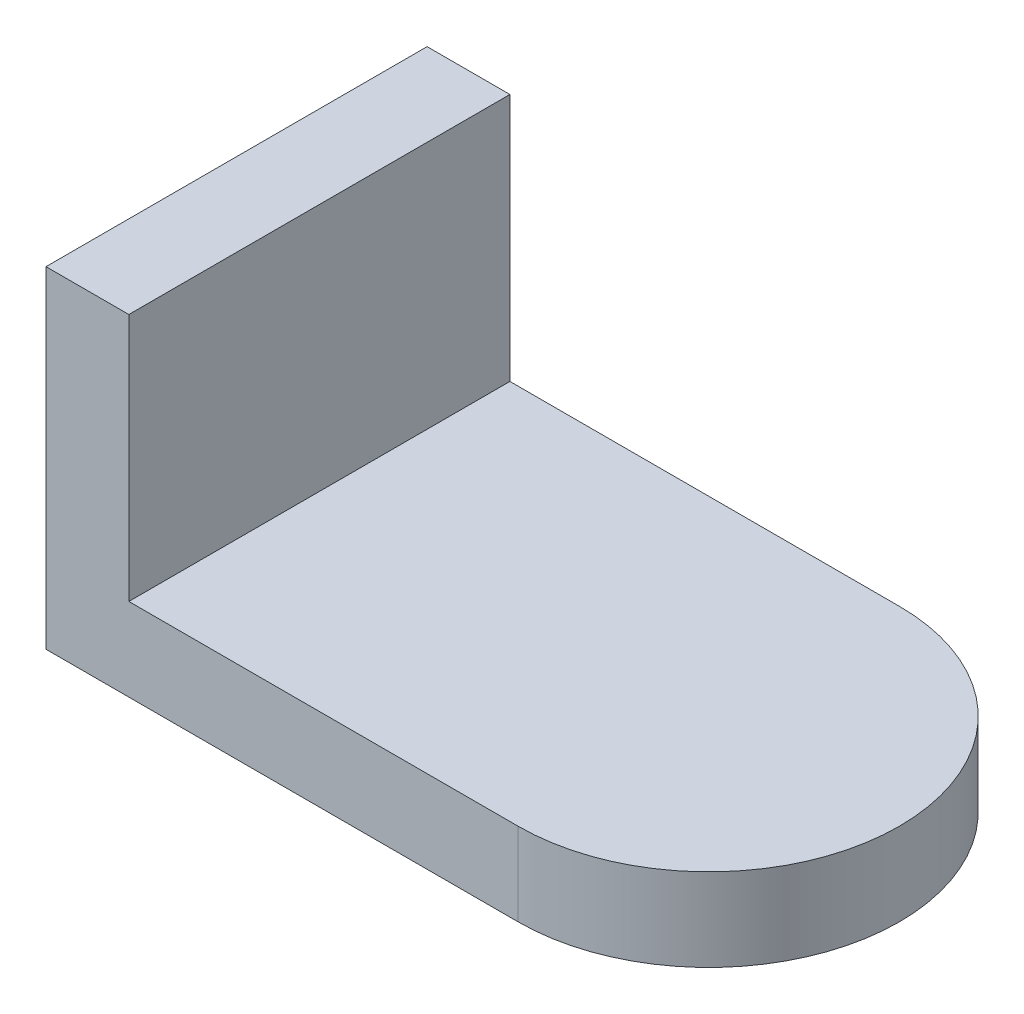
ISO-10303-21;
HEADER;
FILE_DESCRIPTION(('STEP AP214'),'2;1');
FILE_NAME('part.step','',(''),(''),'','','');
FILE_SCHEMA(('AUTOMOTIVE_DESIGN { 1 0 10303 214 1 1 1 1 }'));
ENDSEC;
DATA;
#1=APPLICATION_CONTEXT('core data for automotive mechanical design processes');
#2=APPLICATION_PROTOCOL_DEFINITION('international standard','automotive_design',2000,#1);
#3=PRODUCT_CONTEXT('',#1,'mechanical');
#4=PRODUCT('Part','Part','',(#3));
#5=PRODUCT_RELATED_PRODUCT_CATEGORY('part','',(#4));
#6=PRODUCT_DEFINITION_FORMATION('','',#4);
#7=PRODUCT_DEFINITION_CONTEXT('part definition',#1,'design');
#8=PRODUCT_DEFINITION('design','',#6,#7);
#9=PRODUCT_DEFINITION_SHAPE('','',#8);
#10=(LENGTH_UNIT() NAMED_UNIT(*) SI_UNIT(.MILLI.,.METRE.));
#11=(NAMED_UNIT(*) PLANE_ANGLE_UNIT() SI_UNIT($,.RADIAN.));
#12=(NAMED_UNIT(*) SI_UNIT($,.STERADIAN.) SOLID_ANGLE_UNIT());
#13=UNCERTAINTY_MEASURE_WITH_UNIT(LENGTH_MEASURE(1.E-05),#10,'distance_accuracy_value','');
#14=(GEOMETRIC_REPRESENTATION_CONTEXT(3) GLOBAL_UNCERTAINTY_ASSIGNED_CONTEXT((#13)) GLOBAL_UNIT_ASSIGNED_CONTEXT((#10,
#11,#12)) REPRESENTATION_CONTEXT('',''));
#15=CARTESIAN_POINT('',(0.,0.,0.));
#16=DIRECTION('',(0.,0.,1.));
#17=DIRECTION('',(1.,0.,0.));
#18=AXIS2_PLACEMENT_3D('',#15,#16,#17);
#19=CARTESIAN_POINT('',(-1.45,-0.2,0.135));
#20=DIRECTION('',(0.,0.,-1.));
#21=DIRECTION('',(-1.,0.,0.));
#22=AXIS2_PLACEMENT_3D('',#19,#20,#21);
#23=PLANE('',#22);
#24=DIRECTION('',(0.,-1.,0.));
#25=VECTOR('',#24,1.);
#26=CARTESIAN_POINT('',(-1.5,-0.2,0.135));
#27=LINE('',#26,#25);
#28=CARTESIAN_POINT('',(-1.5,-0.2,0.135));
#29=VERTEX_POINT('',#28);
#30=CARTESIAN_POINT('',(-1.5,-0.4,0.135));
#31=VERTEX_POINT('',#30);
#32=EDGE_CURVE('E11',#29,#31,#27,.T.);
#33=ORIENTED_EDGE('',*,*,#32,.F.);
#34=DIRECTION('',(-1.,0.,0.));
#35=VECTOR('',#34,1.);
#36=CARTESIAN_POINT('',(-1.45,-0.2,0.135));
#37=LINE('',#36,#35);
#38=CARTESIAN_POINT('',(-1.45,-0.2,0.135));
#39=VERTEX_POINT('',#38);
#40=EDGE_CURVE('E24',#39,#29,#37,.T.);
#41=ORIENTED_EDGE('',*,*,#40,.F.);
#42=DIRECTION('',(0.,-1.,0.));
#43=VECTOR('',#42,1.);
#44=CARTESIAN_POINT('',(-1.45,-0.2,0.135));
#45=LINE('',#44,#43);
#46=CARTESIAN_POINT('',(-1.45,-0.35,0.135));
#47=VERTEX_POINT('',#46);
#48=EDGE_CURVE('E116',#39,#47,#45,.T.);
#49=ORIENTED_EDGE('',*,*,#48,.T.);
#50=DIRECTION('',(1.,0.,0.));
#51=VECTOR('',#50,1.);
#52=CARTESIAN_POINT('',(-1.45,-0.35,0.135));
#53=LINE('',#52,#51);
#54=CARTESIAN_POINT('',(-1.215,-0.35,0.135));
#55=VERTEX_POINT('',#54);
#56=EDGE_CURVE('E90',#47,#55,#53,.T.);
#57=ORIENTED_EDGE('',*,*,#56,.T.);
#58=DIRECTION('',(0.,-1.,0.));
#59=VECTOR('',#58,1.);
#60=CARTESIAN_POINT('',(-1.215,-0.35,0.135));
#61=LINE('',#60,#59);
#62=CARTESIAN_POINT('',(-1.215,-0.4,0.135));
#63=VERTEX_POINT('',#62);
#64=EDGE_CURVE('E113',#55,#63,#61,.T.);
#65=ORIENTED_EDGE('',*,*,#64,.T.);
#66=DIRECTION('',(-1.,0.,0.));
#67=VECTOR('',#66,1.);
#68=CARTESIAN_POINT('',(-1.45,-0.4,0.135));
#69=LINE('',#68,#67);
#70=EDGE_CURVE('E111',#63,#31,#69,.T.);
#71=ORIENTED_EDGE('',*,*,#70,.T.);
#72=EDGE_LOOP('',(#33,#41,#49,#57,#65,#71));
#73=FACE_BOUND('',#72,.T.);
#74=ADVANCED_FACE('F17',(#73),#23,.T.);
#75=CARTESIAN_POINT('',(-1.45,-0.2,0.135));
#76=DIRECTION('',(0.,1.,0.));
#77=DIRECTION('',(0.,0.,1.));
#78=AXIS2_PLACEMENT_3D('',#75,#76,#77);
#79=PLANE('',#78);
#80=DIRECTION('',(0.,0.,-1.));
#81=VECTOR('',#80,1.);
#82=CARTESIAN_POINT('',(-1.5,-0.2,0.135));
#83=LINE('',#82,#81);
#84=CARTESIAN_POINT('',(-1.5,-0.2,0.365));
#85=VERTEX_POINT('',#84);
#86=EDGE_CURVE('E109',#85,#29,#83,.T.);
#87=ORIENTED_EDGE('',*,*,#86,.F.);
#88=DIRECTION('',(-1.,0.,0.));
#89=VECTOR('',#88,1.);
#90=CARTESIAN_POINT('',(-1.45,-0.2,0.365));
#91=LINE('',#90,#89);
#92=CARTESIAN_POINT('',(-1.45,-0.2,0.365));
#93=VERTEX_POINT('',#92);
#94=EDGE_CURVE('E107',#93,#85,#91,.T.);
#95=ORIENTED_EDGE('',*,*,#94,.F.);
#96=DIRECTION('',(0.,0.,-1.));
#97=VECTOR('',#96,1.);
#98=CARTESIAN_POINT('',(-1.45,-0.2,0.135));
#99=LINE('',#98,#97);
#100=EDGE_CURVE('E85',#93,#39,#99,.T.);
#101=ORIENTED_EDGE('',*,*,#100,.T.);
#102=ORIENTED_EDGE('',*,*,#40,.T.);
#103=EDGE_LOOP('',(#87,#95,#101,#102));
#104=FACE_BOUND('',#103,.T.);
#105=ADVANCED_FACE('F118',(#104),#79,.T.);
#106=CARTESIAN_POINT('',(-1.45,-0.2,0.365));
#107=DIRECTION('',(0.,0.,1.));
#108=DIRECTION('',(0.,-1.,0.));
#109=AXIS2_PLACEMENT_3D('',#106,#107,#108);
#110=PLANE('',#109);
#111=DIRECTION('',(0.,1.,0.));
#112=VECTOR('',#111,1.);
#113=CARTESIAN_POINT('',(-1.5,-0.2,0.365));
#114=LINE('',#113,#112);
#115=CARTESIAN_POINT('',(-1.5,-0.4,0.365000000000001));
#116=VERTEX_POINT('',#115);
#117=EDGE_CURVE('E103',#116,#85,#114,.T.);
#118=ORIENTED_EDGE('',*,*,#117,.F.);
#119=DIRECTION('',(-1.,0.,0.));
#120=VECTOR('',#119,1.);
#121=CARTESIAN_POINT('',(-1.45,-0.4,0.365000000000001));
#122=LINE('',#121,#120);
#123=CARTESIAN_POINT('',(-1.215,-0.4,0.365000000000001));
#124=VERTEX_POINT('',#123);
#125=EDGE_CURVE('E100',#124,#116,#122,.T.);
#126=ORIENTED_EDGE('',*,*,#125,.F.);
#127=DIRECTION('',(0.,-1.,0.));
#128=VECTOR('',#127,1.);
#129=CARTESIAN_POINT('',(-1.215,-0.35,0.365000000000001));
#130=LINE('',#129,#128);
#131=CARTESIAN_POINT('',(-1.215,-0.35,0.365000000000001));
#132=VERTEX_POINT('',#131);
#133=EDGE_CURVE('E72',#132,#124,#130,.T.);
#134=ORIENTED_EDGE('',*,*,#133,.F.);
#135=DIRECTION('',(-1.,0.,0.));
#136=VECTOR('',#135,1.);
#137=CARTESIAN_POINT('',(-1.45,-0.35,0.365000000000001));
#138=LINE('',#137,#136);
#139=CARTESIAN_POINT('',(-1.45,-0.35,0.365000000000001));
#140=VERTEX_POINT('',#139);
#141=EDGE_CURVE('E66',#132,#140,#138,.T.);
#142=ORIENTED_EDGE('',*,*,#141,.T.);
#143=DIRECTION('',(0.,1.,0.));
#144=VECTOR('',#143,1.);
#145=CARTESIAN_POINT('',(-1.45,-0.2,0.365));
#146=LINE('',#145,#144);
#147=EDGE_CURVE('E70',#140,#93,#146,.T.);
#148=ORIENTED_EDGE('',*,*,#147,.T.);
#149=ORIENTED_EDGE('',*,*,#94,.T.);
#150=EDGE_LOOP('',(#118,#126,#134,#142,#148,#149));
#151=FACE_BOUND('',#150,.T.);
#152=ADVANCED_FACE('F68',(#151),#110,.T.);
#153=CARTESIAN_POINT('',(-1.45,-0.4,0.135));
#154=DIRECTION('',(0.,-1.,0.));
#155=DIRECTION('',(0.,0.,-1.));
#156=AXIS2_PLACEMENT_3D('',#153,#154,#155);
#157=PLANE('',#156);
#158=DIRECTION('',(0.,0.,1.));
#159=VECTOR('',#158,1.);
#160=CARTESIAN_POINT('',(-1.5,-0.4,0.135));
#161=LINE('',#160,#159);
#162=EDGE_CURVE('E86',#31,#116,#161,.T.);
#163=ORIENTED_EDGE('',*,*,#162,.F.);
#164=ORIENTED_EDGE('',*,*,#70,.F.);
#165=CARTESIAN_POINT('',(-1.215,-0.4,0.250000000000001));
#166=DIRECTION('',(0.,-1.,0.));
#167=DIRECTION('',(0.,0.,1.));
#168=AXIS2_PLACEMENT_3D('',#165,#166,#167);
#169=CIRCLE('',#168,0.115);
#170=EDGE_CURVE('E91',#63,#124,#169,.T.);
#171=ORIENTED_EDGE('',*,*,#170,.T.);
#172=ORIENTED_EDGE('',*,*,#125,.T.);
#173=EDGE_LOOP('',(#163,#164,#171,#172));
#174=FACE_BOUND('',#173,.T.);
#175=ADVANCED_FACE('F122',(#174),#157,.T.);
#176=CARTESIAN_POINT('',(-1.45,0.,0.));
#177=DIRECTION('',(-1.,0.,0.));
#178=DIRECTION('',(0.,0.,1.));
#179=AXIS2_PLACEMENT_3D('',#176,#177,#178);
#180=PLANE('',#179);
#181=ORIENTED_EDGE('',*,*,#147,.F.);
#182=DIRECTION('',(0.,0.,-1.));
#183=VECTOR('',#182,1.);
#184=CARTESIAN_POINT('',(-1.45,-0.35,0.135));
#185=LINE('',#184,#183);
#186=EDGE_CURVE('E83',#140,#47,#185,.T.);
#187=ORIENTED_EDGE('',*,*,#186,.T.);
#188=ORIENTED_EDGE('',*,*,#48,.F.);
#189=ORIENTED_EDGE('',*,*,#100,.F.);
#190=EDGE_LOOP('',(#181,#187,#188,#189));
#191=FACE_BOUND('',#190,.T.);
#192=ADVANCED_FACE('F81',(#191),#180,.F.);
#193=CARTESIAN_POINT('',(-1.5,0.,0.));
#194=DIRECTION('',(-1.,0.,0.));
#195=DIRECTION('',(0.,0.,1.));
#196=AXIS2_PLACEMENT_3D('',#193,#194,#195);
#197=PLANE('',#196);
#198=ORIENTED_EDGE('',*,*,#32,.T.);
#199=ORIENTED_EDGE('',*,*,#162,.T.);
#200=ORIENTED_EDGE('',*,*,#117,.T.);
#201=ORIENTED_EDGE('',*,*,#86,.T.);
#202=EDGE_LOOP('',(#198,#199,#200,#201));
#203=FACE_BOUND('',#202,.T.);
#204=ADVANCED_FACE('F119',(#203),#197,.T.);
#205=CARTESIAN_POINT('',(-1.215,-0.35,0.250000000000001));
#206=DIRECTION('',(0.,-1.,0.));
#207=DIRECTION('',(0.,0.,-1.));
#208=AXIS2_PLACEMENT_3D('',#205,#206,#207);
#209=CYLINDRICAL_SURFACE('',#208,0.115);
#210=ORIENTED_EDGE('',*,*,#170,.F.);
#211=ORIENTED_EDGE('',*,*,#64,.F.);
#212=CARTESIAN_POINT('',(-1.215,-0.35,0.250000000000001));
#213=DIRECTION('',(0.,-1.,0.));
#214=DIRECTION('',(0.,0.,1.));
#215=AXIS2_PLACEMENT_3D('',#212,#213,#214);
#216=CIRCLE('',#215,0.115);
#217=EDGE_CURVE('E92',#55,#132,#216,.T.);
#218=ORIENTED_EDGE('',*,*,#217,.T.);
#219=ORIENTED_EDGE('',*,*,#133,.T.);
#220=EDGE_LOOP('',(#210,#211,#218,#219));
#221=FACE_BOUND('',#220,.T.);
#222=ADVANCED_FACE('F127',(#221),#209,.T.);
#223=CARTESIAN_POINT('',(-1.215,-0.35,0.250000000000001));
#224=DIRECTION('',(0.,1.,0.));
#225=DIRECTION('',(0.,0.,1.));
#226=AXIS2_PLACEMENT_3D('',#223,#224,#225);
#227=PLANE('',#226);
#228=ORIENTED_EDGE('',*,*,#186,.F.);
#229=ORIENTED_EDGE('',*,*,#141,.F.);
#230=ORIENTED_EDGE('',*,*,#217,.F.);
#231=ORIENTED_EDGE('',*,*,#56,.F.);
#232=EDGE_LOOP('',(#228,#229,#230,#231));
#233=FACE_BOUND('',#232,.T.);
#234=ADVANCED_FACE('F89',(#233),#227,.T.);
#235=CLOSED_SHELL('',(#74,#105,#152,#175,#192,#204,#222,#234));
#236=MANIFOLD_SOLID_BREP('B1',#235);
#237=ADVANCED_BREP_SHAPE_REPRESENTATION('',(#18,#236),#14);
#238=SHAPE_DEFINITION_REPRESENTATION(#9,#237);
ENDSEC;
END-ISO-10303-21;
